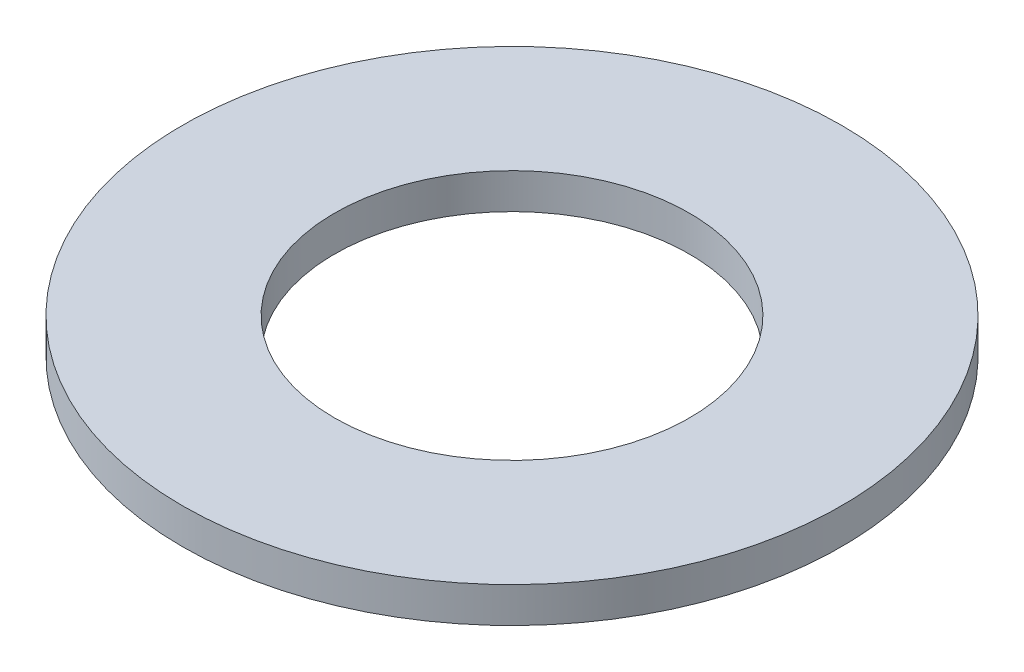
ISO-10303-21;
HEADER;
FILE_DESCRIPTION(('STEP AP214'),'2;1');
FILE_NAME('part.step','',(''),(''),'','','');
FILE_SCHEMA(('AUTOMOTIVE_DESIGN { 1 0 10303 214 1 1 1 1 }'));
ENDSEC;
DATA;
#1=APPLICATION_CONTEXT('core data for automotive mechanical design processes');
#2=APPLICATION_PROTOCOL_DEFINITION('international standard','automotive_design',2000,#1);
#3=PRODUCT_CONTEXT('',#1,'mechanical');
#4=PRODUCT('Part','Part','',(#3));
#5=PRODUCT_RELATED_PRODUCT_CATEGORY('part','',(#4));
#6=PRODUCT_DEFINITION_FORMATION('','',#4);
#7=PRODUCT_DEFINITION_CONTEXT('part definition',#1,'design');
#8=PRODUCT_DEFINITION('design','',#6,#7);
#9=PRODUCT_DEFINITION_SHAPE('','',#8);
#10=(LENGTH_UNIT() NAMED_UNIT(*) SI_UNIT(.MILLI.,.METRE.));
#11=(NAMED_UNIT(*) PLANE_ANGLE_UNIT() SI_UNIT($,.RADIAN.));
#12=(NAMED_UNIT(*) SI_UNIT($,.STERADIAN.) SOLID_ANGLE_UNIT());
#13=UNCERTAINTY_MEASURE_WITH_UNIT(LENGTH_MEASURE(1.E-05),#10,'distance_accuracy_value','');
#14=(GEOMETRIC_REPRESENTATION_CONTEXT(3) GLOBAL_UNCERTAINTY_ASSIGNED_CONTEXT((#13)) GLOBAL_UNIT_ASSIGNED_CONTEXT((#10,
#11,#12)) REPRESENTATION_CONTEXT('',''));
#15=CARTESIAN_POINT('',(0.,0.,0.));
#16=DIRECTION('',(0.,0.,1.));
#17=DIRECTION('',(1.,0.,0.));
#18=AXIS2_PLACEMENT_3D('',#15,#16,#17);
#19=CARTESIAN_POINT('',(0.,7.,0.));
#20=DIRECTION('',(0.,-1.,0.));
#21=DIRECTION('',(0.,0.,-1.));
#22=AXIS2_PLACEMENT_3D('',#19,#20,#21);
#23=CYLINDRICAL_SURFACE('',#22,65.);
#24=CARTESIAN_POINT('',(0.,7.,0.));
#25=DIRECTION('',(0.,1.,0.));
#26=DIRECTION('',(0.,0.,1.));
#27=AXIS2_PLACEMENT_3D('',#24,#25,#26);
#28=CIRCLE('',#27,65.);
#29=CARTESIAN_POINT('',(0.,7.,65.));
#30=VERTEX_POINT('',#29);
#31=EDGE_CURVE('E10',#30,#30,#28,.T.);
#32=ORIENTED_EDGE('',*,*,#31,.F.);
#33=EDGE_LOOP('',(#32));
#34=FACE_BOUND('',#33,.T.);
#35=CARTESIAN_POINT('',(0.,0.,0.));
#36=DIRECTION('',(0.,1.,0.));
#37=DIRECTION('',(0.,0.,1.));
#38=AXIS2_PLACEMENT_3D('',#35,#36,#37);
#39=CIRCLE('',#38,65.);
#40=CARTESIAN_POINT('',(0.,0.,65.));
#41=VERTEX_POINT('',#40);
#42=EDGE_CURVE('E37',#41,#41,#39,.T.);
#43=ORIENTED_EDGE('',*,*,#42,.T.);
#44=EDGE_LOOP('',(#43));
#45=FACE_BOUND('',#44,.T.);
#46=ADVANCED_FACE('F40',(#34,#45),#23,.T.);
#47=CARTESIAN_POINT('',(0.,7.,0.));
#48=DIRECTION('',(0.,1.,0.));
#49=DIRECTION('',(0.,0.,1.));
#50=AXIS2_PLACEMENT_3D('',#47,#48,#49);
#51=PLANE('',#50);
#52=CARTESIAN_POINT('',(0.,7.,0.));
#53=DIRECTION('',(0.,1.,0.));
#54=DIRECTION('',(0.,0.,1.));
#55=AXIS2_PLACEMENT_3D('',#52,#53,#54);
#56=CIRCLE('',#55,35.);
#57=CARTESIAN_POINT('',(0.,7.,35.));
#58=VERTEX_POINT('',#57);
#59=EDGE_CURVE('E50',#58,#58,#56,.T.);
#60=ORIENTED_EDGE('',*,*,#59,.F.);
#61=EDGE_LOOP('',(#60));
#62=FACE_BOUND('',#61,.T.);
#63=ORIENTED_EDGE('',*,*,#31,.T.);
#64=EDGE_LOOP('',(#63));
#65=FACE_BOUND('',#64,.T.);
#66=ADVANCED_FACE('F59',(#62,#65),#51,.T.);
#67=CARTESIAN_POINT('',(0.,0.,0.));
#68=DIRECTION('',(0.,1.,0.));
#69=DIRECTION('',(0.,0.,1.));
#70=AXIS2_PLACEMENT_3D('',#67,#68,#69);
#71=PLANE('',#70);
#72=CARTESIAN_POINT('',(0.,0.,0.));
#73=DIRECTION('',(0.,1.,0.));
#74=DIRECTION('',(0.,0.,1.));
#75=AXIS2_PLACEMENT_3D('',#72,#73,#74);
#76=CIRCLE('',#75,35.);
#77=CARTESIAN_POINT('',(0.,0.,35.));
#78=VERTEX_POINT('',#77);
#79=EDGE_CURVE('E47',#78,#78,#76,.T.);
#80=ORIENTED_EDGE('',*,*,#79,.T.);
#81=EDGE_LOOP('',(#80));
#82=FACE_BOUND('',#81,.T.);
#83=ORIENTED_EDGE('',*,*,#42,.F.);
#84=EDGE_LOOP('',(#83));
#85=FACE_BOUND('',#84,.T.);
#86=ADVANCED_FACE('F58',(#82,#85),#71,.F.);
#87=CARTESIAN_POINT('',(0.,7.,0.));
#88=DIRECTION('',(0.,-1.,0.));
#89=DIRECTION('',(0.,0.,-1.));
#90=AXIS2_PLACEMENT_3D('',#87,#88,#89);
#91=CYLINDRICAL_SURFACE('',#90,35.);
#92=ORIENTED_EDGE('',*,*,#59,.T.);
#93=EDGE_LOOP('',(#92));
#94=FACE_BOUND('',#93,.T.);
#95=ORIENTED_EDGE('',*,*,#79,.F.);
#96=EDGE_LOOP('',(#95));
#97=FACE_BOUND('',#96,.T.);
#98=ADVANCED_FACE('F54',(#94,#97),#91,.F.);
#99=CLOSED_SHELL('',(#46,#66,#86,#98));
#100=MANIFOLD_SOLID_BREP('B2',#99);
#101=ADVANCED_BREP_SHAPE_REPRESENTATION('',(#18,#100),#14);
#102=SHAPE_DEFINITION_REPRESENTATION(#9,#101);
ENDSEC;
END-ISO-10303-21;
